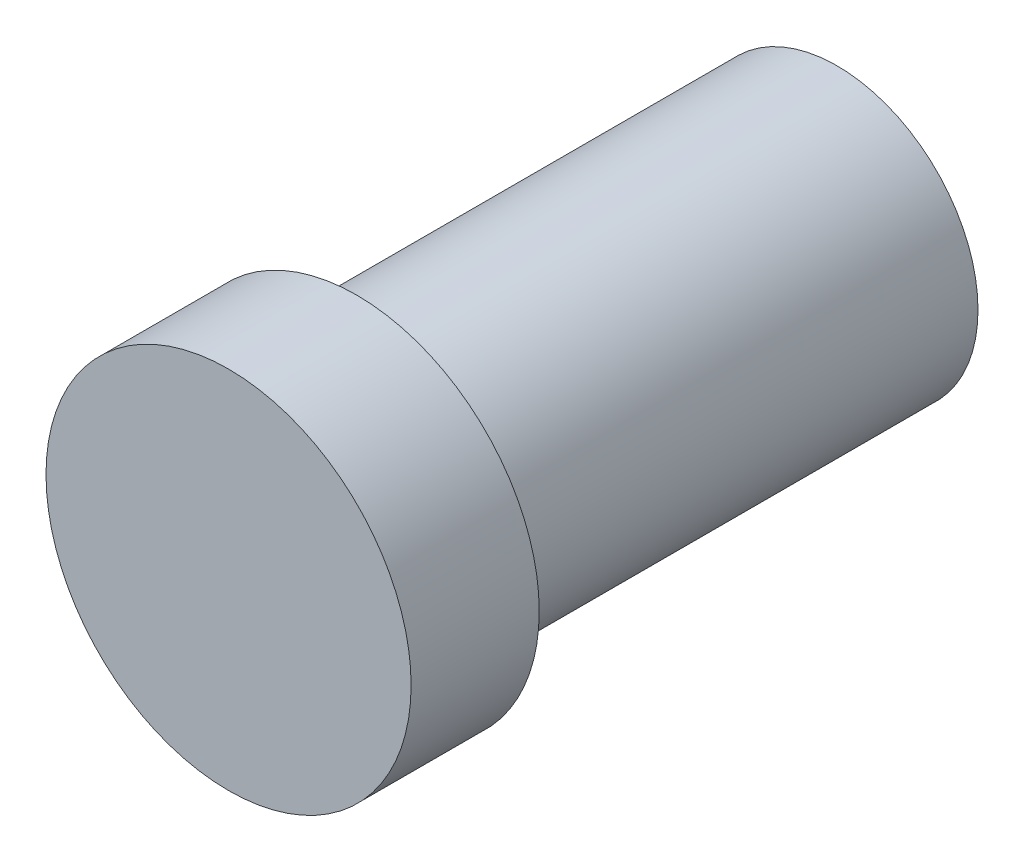
ISO-10303-21;
HEADER;
FILE_DESCRIPTION(('STEP AP214'),'2;1');
FILE_NAME('part.step','',(''),(''),'','','');
FILE_SCHEMA(('AUTOMOTIVE_DESIGN { 1 0 10303 214 1 1 1 1 }'));
ENDSEC;
DATA;
#1=APPLICATION_CONTEXT('core data for automotive mechanical design processes');
#2=APPLICATION_PROTOCOL_DEFINITION('international standard','automotive_design',2000,#1);
#3=PRODUCT_CONTEXT('',#1,'mechanical');
#4=PRODUCT('Part','Part','',(#3));
#5=PRODUCT_RELATED_PRODUCT_CATEGORY('part','',(#4));
#6=PRODUCT_DEFINITION_FORMATION('','',#4);
#7=PRODUCT_DEFINITION_CONTEXT('part definition',#1,'design');
#8=PRODUCT_DEFINITION('design','',#6,#7);
#9=PRODUCT_DEFINITION_SHAPE('','',#8);
#10=(LENGTH_UNIT() NAMED_UNIT(*) SI_UNIT(.MILLI.,.METRE.));
#11=(NAMED_UNIT(*) PLANE_ANGLE_UNIT() SI_UNIT($,.RADIAN.));
#12=(NAMED_UNIT(*) SI_UNIT($,.STERADIAN.) SOLID_ANGLE_UNIT());
#13=UNCERTAINTY_MEASURE_WITH_UNIT(LENGTH_MEASURE(1.E-05),#10,'distance_accuracy_value','');
#14=(GEOMETRIC_REPRESENTATION_CONTEXT(3) GLOBAL_UNCERTAINTY_ASSIGNED_CONTEXT((#13)) GLOBAL_UNIT_ASSIGNED_CONTEXT((#10,
#11,#12)) REPRESENTATION_CONTEXT('',''));
#15=CARTESIAN_POINT('',(0.,0.,0.));
#16=DIRECTION('',(0.,0.,1.));
#17=DIRECTION('',(1.,0.,0.));
#18=AXIS2_PLACEMENT_3D('',#15,#16,#17);
#19=CARTESIAN_POINT('',(0.,0.,-75.));
#20=DIRECTION('',(0.,0.,1.));
#21=DIRECTION('',(1.,0.,0.));
#22=AXIS2_PLACEMENT_3D('',#19,#20,#21);
#23=CYLINDRICAL_SURFACE('',#22,22.);
#24=CARTESIAN_POINT('',(0.,0.,-2.));
#25=DIRECTION('',(0.,0.,1.));
#26=DIRECTION('',(1.,0.,0.));
#27=AXIS2_PLACEMENT_3D('',#24,#25,#26);
#28=CIRCLE('',#27,22.);
#29=CARTESIAN_POINT('',(22.,0.,-2.));
#30=VERTEX_POINT('',#29);
#31=EDGE_CURVE('E10',#30,#30,#28,.F.);
#32=ORIENTED_EDGE('',*,*,#31,.T.);
#33=EDGE_LOOP('',(#32));
#34=FACE_BOUND('',#33,.T.);
#35=CARTESIAN_POINT('',(0.,0.,-75.));
#36=DIRECTION('',(0.,0.,1.));
#37=DIRECTION('',(1.,0.,0.));
#38=AXIS2_PLACEMENT_3D('',#35,#36,#37);
#39=CIRCLE('',#38,22.);
#40=CARTESIAN_POINT('',(22.,0.,-75.));
#41=VERTEX_POINT('',#40);
#42=EDGE_CURVE('E42',#41,#41,#39,.T.);
#43=ORIENTED_EDGE('',*,*,#42,.T.);
#44=EDGE_LOOP('',(#43));
#45=FACE_BOUND('',#44,.T.);
#46=ADVANCED_FACE('F31',(#34,#45),#23,.T.);
#47=CARTESIAN_POINT('',(0.,0.,-75.));
#48=DIRECTION('',(0.,0.,1.));
#49=DIRECTION('',(1.,0.,0.));
#50=AXIS2_PLACEMENT_3D('',#47,#48,#49);
#51=PLANE('',#50);
#52=ORIENTED_EDGE('',*,*,#42,.F.);
#53=EDGE_LOOP('',(#52));
#54=FACE_BOUND('',#53,.T.);
#55=ADVANCED_FACE('F60',(#54),#51,.F.);
#56=CARTESIAN_POINT('',(0.,0.,20.));
#57=DIRECTION('',(0.,0.,-1.));
#58=DIRECTION('',(-1.,0.,0.));
#59=AXIS2_PLACEMENT_3D('',#56,#57,#58);
#60=CYLINDRICAL_SURFACE('',#59,28.5);
#61=CARTESIAN_POINT('',(0.,0.,20.));
#62=DIRECTION('',(0.,0.,1.));
#63=DIRECTION('',(1.,0.,0.));
#64=AXIS2_PLACEMENT_3D('',#61,#62,#63);
#65=CIRCLE('',#64,28.5);
#66=CARTESIAN_POINT('',(28.5,0.,20.));
#67=VERTEX_POINT('',#66);
#68=EDGE_CURVE('E46',#67,#67,#65,.T.);
#69=ORIENTED_EDGE('',*,*,#68,.F.);
#70=EDGE_LOOP('',(#69));
#71=FACE_BOUND('',#70,.T.);
#72=CARTESIAN_POINT('',(0.,0.,0.));
#73=DIRECTION('',(0.,0.,1.));
#74=DIRECTION('',(1.,0.,0.));
#75=AXIS2_PLACEMENT_3D('',#72,#73,#74);
#76=CIRCLE('',#75,28.5);
#77=CARTESIAN_POINT('',(28.5,0.,0.));
#78=VERTEX_POINT('',#77);
#79=EDGE_CURVE('E49',#78,#78,#76,.T.);
#80=ORIENTED_EDGE('',*,*,#79,.T.);
#81=EDGE_LOOP('',(#80));
#82=FACE_BOUND('',#81,.T.);
#83=ADVANCED_FACE('F57',(#71,#82),#60,.T.);
#84=CARTESIAN_POINT('',(0.,0.,20.));
#85=DIRECTION('',(0.,0.,1.));
#86=DIRECTION('',(1.,0.,0.));
#87=AXIS2_PLACEMENT_3D('',#84,#85,#86);
#88=PLANE('',#87);
#89=ORIENTED_EDGE('',*,*,#68,.T.);
#90=EDGE_LOOP('',(#89));
#91=FACE_BOUND('',#90,.T.);
#92=ADVANCED_FACE('F55',(#91),#88,.T.);
#93=CARTESIAN_POINT('',(0.,0.,0.));
#94=DIRECTION('',(0.,0.,1.));
#95=DIRECTION('',(1.,0.,0.));
#96=AXIS2_PLACEMENT_3D('',#93,#94,#95);
#97=PLANE('',#96);
#98=CARTESIAN_POINT('',(0.,0.,0.));
#99=DIRECTION('',(0.,0.,1.));
#100=DIRECTION('',(1.,0.,0.));
#101=AXIS2_PLACEMENT_3D('',#98,#99,#100);
#102=CIRCLE('',#101,24.);
#103=CARTESIAN_POINT('',(24.,0.,0.));
#104=VERTEX_POINT('',#103);
#105=EDGE_CURVE('E38',#104,#104,#102,.T.);
#106=ORIENTED_EDGE('',*,*,#105,.T.);
#107=EDGE_LOOP('',(#106));
#108=FACE_BOUND('',#107,.T.);
#109=ORIENTED_EDGE('',*,*,#79,.F.);
#110=EDGE_LOOP('',(#109));
#111=FACE_BOUND('',#110,.T.);
#112=ADVANCED_FACE('F64',(#108,#111),#97,.F.);
#113=CARTESIAN_POINT('',(0.,0.,-2.));
#114=DIRECTION('',(0.,0.,1.));
#115=DIRECTION('',(1.,0.,0.));
#116=AXIS2_PLACEMENT_3D('',#113,#114,#115);
#117=TOROIDAL_SURFACE('',#116,24.,2.);
#118=ORIENTED_EDGE('',*,*,#31,.F.);
#119=EDGE_LOOP('',(#118));
#120=FACE_BOUND('',#119,.T.);
#121=ORIENTED_EDGE('',*,*,#105,.F.);
#122=EDGE_LOOP('',(#121));
#123=FACE_BOUND('',#122,.T.);
#124=ADVANCED_FACE('F33',(#120,#123),#117,.F.);
#125=CLOSED_SHELL('',(#46,#55,#83,#92,#112,#124));
#126=MANIFOLD_SOLID_BREP('B2',#125);
#127=ADVANCED_BREP_SHAPE_REPRESENTATION('',(#18,#126),#14);
#128=SHAPE_DEFINITION_REPRESENTATION(#9,#127);
ENDSEC;
END-ISO-10303-21;
